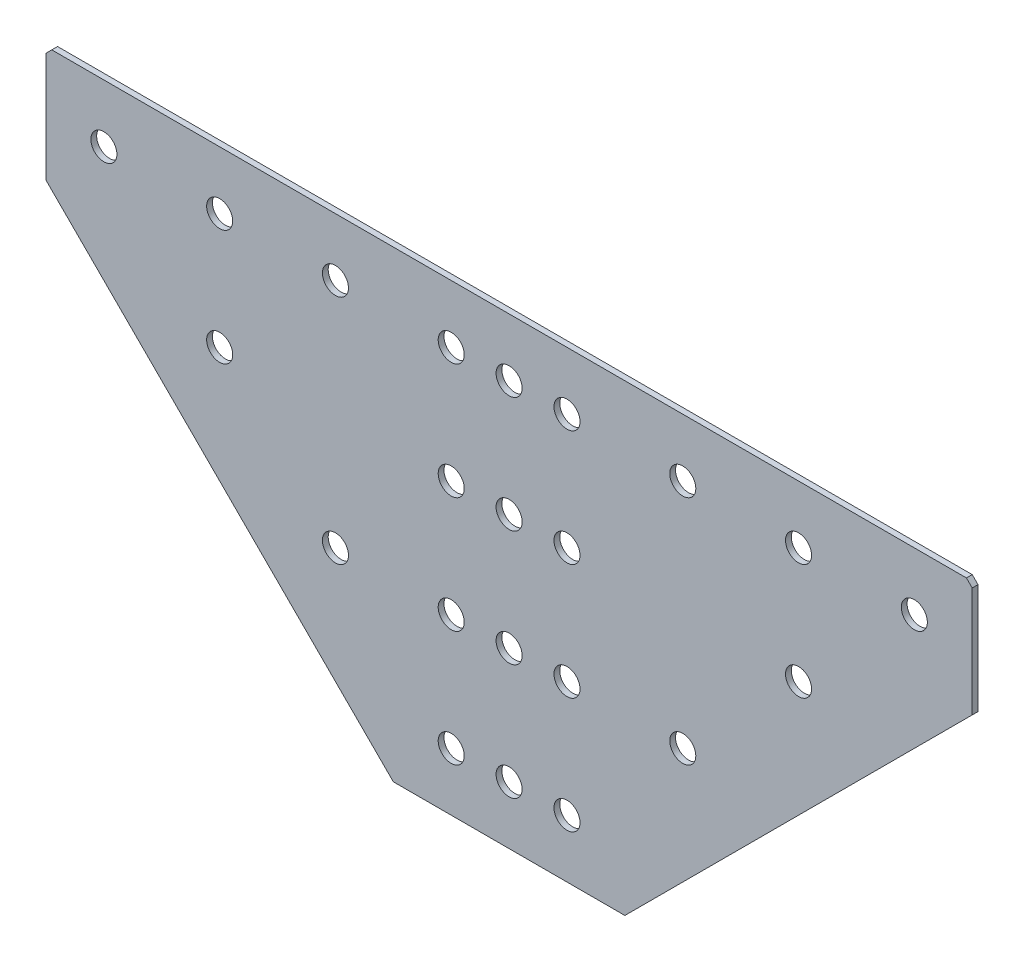
ISO-10303-21;
HEADER;
FILE_DESCRIPTION(('STEP AP214'),'2;1');
FILE_NAME('part.step','',(''),(''),'','','');
FILE_SCHEMA(('AUTOMOTIVE_DESIGN { 1 0 10303 214 1 1 1 1 }'));
ENDSEC;
DATA;
#1=APPLICATION_CONTEXT('core data for automotive mechanical design processes');
#2=APPLICATION_PROTOCOL_DEFINITION('international standard','automotive_design',2000,#1);
#3=PRODUCT_CONTEXT('',#1,'mechanical');
#4=PRODUCT('Part','Part','',(#3));
#5=PRODUCT_RELATED_PRODUCT_CATEGORY('part','',(#4));
#6=PRODUCT_DEFINITION_FORMATION('','',#4);
#7=PRODUCT_DEFINITION_CONTEXT('part definition',#1,'design');
#8=PRODUCT_DEFINITION('design','',#6,#7);
#9=PRODUCT_DEFINITION_SHAPE('','',#8);
#10=(LENGTH_UNIT() NAMED_UNIT(*) SI_UNIT(.MILLI.,.METRE.));
#11=(NAMED_UNIT(*) PLANE_ANGLE_UNIT() SI_UNIT($,.RADIAN.));
#12=(NAMED_UNIT(*) SI_UNIT($,.STERADIAN.) SOLID_ANGLE_UNIT());
#13=UNCERTAINTY_MEASURE_WITH_UNIT(LENGTH_MEASURE(1.E-05),#10,'distance_accuracy_value','');
#14=(GEOMETRIC_REPRESENTATION_CONTEXT(3) GLOBAL_UNCERTAINTY_ASSIGNED_CONTEXT((#13)) GLOBAL_UNIT_ASSIGNED_CONTEXT((#10,
#11,#12)) REPRESENTATION_CONTEXT('',''));
#15=CARTESIAN_POINT('',(0.,0.,0.));
#16=DIRECTION('',(0.,0.,1.));
#17=DIRECTION('',(1.,0.,0.));
#18=AXIS2_PLACEMENT_3D('',#15,#16,#17);
#19=CARTESIAN_POINT('',(-160.,0.,2.));
#20=DIRECTION('',(0.,-1.,0.));
#21=DIRECTION('',(0.,0.,-1.));
#22=AXIS2_PLACEMENT_3D('',#19,#20,#21);
#23=PLANE('',#22);
#24=DIRECTION('',(-1.,0.,0.));
#25=VECTOR('',#24,1.);
#26=CARTESIAN_POINT('',(-160.,0.,0.));
#27=LINE('',#26,#25);
#28=CARTESIAN_POINT('',(158.,0.,0.));
#29=VERTEX_POINT('',#28);
#30=CARTESIAN_POINT('',(-158.,0.,0.));
#31=VERTEX_POINT('',#30);
#32=EDGE_CURVE('E150',#29,#31,#27,.T.);
#33=ORIENTED_EDGE('',*,*,#32,.T.);
#34=DIRECTION('',(0.,0.,1.));
#35=VECTOR('',#34,1.);
#36=CARTESIAN_POINT('',(-158.,0.,2.));
#37=LINE('',#36,#35);
#38=CARTESIAN_POINT('',(-158.,0.,2.));
#39=VERTEX_POINT('',#38);
#40=EDGE_CURVE('E64',#31,#39,#37,.T.);
#41=ORIENTED_EDGE('',*,*,#40,.T.);
#42=DIRECTION('',(-1.,0.,0.));
#43=VECTOR('',#42,1.);
#44=CARTESIAN_POINT('',(-160.,0.,2.));
#45=LINE('',#44,#43);
#46=CARTESIAN_POINT('',(158.,0.,2.));
#47=VERTEX_POINT('',#46);
#48=EDGE_CURVE('E120',#47,#39,#45,.T.);
#49=ORIENTED_EDGE('',*,*,#48,.F.);
#50=DIRECTION('',(0.,0.,-1.));
#51=VECTOR('',#50,1.);
#52=CARTESIAN_POINT('',(158.,0.,2.));
#53=LINE('',#52,#51);
#54=EDGE_CURVE('E185',#47,#29,#53,.T.);
#55=ORIENTED_EDGE('',*,*,#54,.T.);
#56=EDGE_LOOP('',(#33,#41,#49,#55));
#57=FACE_BOUND('',#56,.T.);
#58=ADVANCED_FACE('F41',(#57),#23,.F.);
#59=CARTESIAN_POINT('',(-160.,-40.,2.));
#60=DIRECTION('',(1.,0.,0.));
#61=DIRECTION('',(0.,1.,0.));
#62=AXIS2_PLACEMENT_3D('',#59,#60,#61);
#63=PLANE('',#62);
#64=DIRECTION('',(0.,-1.,0.));
#65=VECTOR('',#64,1.);
#66=CARTESIAN_POINT('',(-160.,-40.,2.));
#67=LINE('',#66,#65);
#68=CARTESIAN_POINT('',(-160.,-2.,2.));
#69=VERTEX_POINT('',#68);
#70=CARTESIAN_POINT('',(-160.,-40.,2.));
#71=VERTEX_POINT('',#70);
#72=EDGE_CURVE('E109',#69,#71,#67,.T.);
#73=ORIENTED_EDGE('',*,*,#72,.F.);
#74=DIRECTION('',(0.,0.,-1.));
#75=VECTOR('',#74,1.);
#76=CARTESIAN_POINT('',(-160.,-2.,2.));
#77=LINE('',#76,#75);
#78=CARTESIAN_POINT('',(-160.,-2.,0.));
#79=VERTEX_POINT('',#78);
#80=EDGE_CURVE('E130',#69,#79,#77,.T.);
#81=ORIENTED_EDGE('',*,*,#80,.T.);
#82=DIRECTION('',(0.,-1.,0.));
#83=VECTOR('',#82,1.);
#84=CARTESIAN_POINT('',(-160.,-40.,0.));
#85=LINE('',#84,#83);
#86=CARTESIAN_POINT('',(-160.,-40.,0.));
#87=VERTEX_POINT('',#86);
#88=EDGE_CURVE('E126',#79,#87,#85,.T.);
#89=ORIENTED_EDGE('',*,*,#88,.T.);
#90=DIRECTION('',(0.,0.,-1.));
#91=VECTOR('',#90,1.);
#92=CARTESIAN_POINT('',(-160.,-40.,2.));
#93=LINE('',#92,#91);
#94=EDGE_CURVE('E123',#71,#87,#93,.T.);
#95=ORIENTED_EDGE('',*,*,#94,.F.);
#96=EDGE_LOOP('',(#73,#81,#89,#95));
#97=FACE_BOUND('',#96,.T.);
#98=ADVANCED_FACE('F124',(#97),#63,.F.);
#99=CARTESIAN_POINT('',(-40.,-160.,2.));
#100=DIRECTION('',(0.707106781186547,0.707106781186547,0.));
#101=DIRECTION('',(-0.707106781186548,0.707106781186548,0.));
#102=AXIS2_PLACEMENT_3D('',#99,#100,#101);
#103=PLANE('',#102);
#104=DIRECTION('',(0.707106781186547,-0.707106781186547,0.));
#105=VECTOR('',#104,1.);
#106=CARTESIAN_POINT('',(-40.,-160.,0.));
#107=LINE('',#106,#105);
#108=CARTESIAN_POINT('',(-40.,-160.,0.));
#109=VERTEX_POINT('',#108);
#110=EDGE_CURVE('E156',#87,#109,#107,.T.);
#111=ORIENTED_EDGE('',*,*,#110,.T.);
#112=DIRECTION('',(0.,0.,-1.));
#113=VECTOR('',#112,1.);
#114=CARTESIAN_POINT('',(-40.,-160.,2.));
#115=LINE('',#114,#113);
#116=CARTESIAN_POINT('',(-40.,-160.,2.));
#117=VERTEX_POINT('',#116);
#118=EDGE_CURVE('E131',#117,#109,#115,.T.);
#119=ORIENTED_EDGE('',*,*,#118,.F.);
#120=DIRECTION('',(0.707106781186547,-0.707106781186547,0.));
#121=VECTOR('',#120,1.);
#122=CARTESIAN_POINT('',(-40.,-160.,2.));
#123=LINE('',#122,#121);
#124=EDGE_CURVE('E113',#71,#117,#123,.T.);
#125=ORIENTED_EDGE('',*,*,#124,.F.);
#126=ORIENTED_EDGE('',*,*,#94,.T.);
#127=EDGE_LOOP('',(#111,#119,#125,#126));
#128=FACE_BOUND('',#127,.T.);
#129=ADVANCED_FACE('F133',(#128),#103,.F.);
#130=CARTESIAN_POINT('',(40.,-160.,2.));
#131=DIRECTION('',(0.,1.,0.));
#132=DIRECTION('',(0.,0.,1.));
#133=AXIS2_PLACEMENT_3D('',#130,#131,#132);
#134=PLANE('',#133);
#135=DIRECTION('',(1.,0.,0.));
#136=VECTOR('',#135,1.);
#137=CARTESIAN_POINT('',(40.,-160.,0.));
#138=LINE('',#137,#136);
#139=CARTESIAN_POINT('',(40.,-160.,0.));
#140=VERTEX_POINT('',#139);
#141=EDGE_CURVE('E159',#109,#140,#138,.T.);
#142=ORIENTED_EDGE('',*,*,#141,.T.);
#143=DIRECTION('',(0.,0.,-1.));
#144=VECTOR('',#143,1.);
#145=CARTESIAN_POINT('',(40.,-160.,2.));
#146=LINE('',#145,#144);
#147=CARTESIAN_POINT('',(40.,-160.,2.));
#148=VERTEX_POINT('',#147);
#149=EDGE_CURVE('E171',#148,#140,#146,.T.);
#150=ORIENTED_EDGE('',*,*,#149,.F.);
#151=DIRECTION('',(1.,0.,0.));
#152=VECTOR('',#151,1.);
#153=CARTESIAN_POINT('',(40.,-160.,2.));
#154=LINE('',#153,#152);
#155=EDGE_CURVE('E137',#117,#148,#154,.T.);
#156=ORIENTED_EDGE('',*,*,#155,.F.);
#157=ORIENTED_EDGE('',*,*,#118,.T.);
#158=EDGE_LOOP('',(#142,#150,#156,#157));
#159=FACE_BOUND('',#158,.T.);
#160=ADVANCED_FACE('F211',(#159),#134,.F.);
#161=CARTESIAN_POINT('',(160.,-40.,2.));
#162=DIRECTION('',(-0.707106781186547,0.707106781186547,0.));
#163=DIRECTION('',(-0.707106781186548,-0.707106781186548,0.));
#164=AXIS2_PLACEMENT_3D('',#161,#162,#163);
#165=PLANE('',#164);
#166=DIRECTION('',(0.707106781186547,0.707106781186547,0.));
#167=VECTOR('',#166,1.);
#168=CARTESIAN_POINT('',(160.,-40.,0.));
#169=LINE('',#168,#167);
#170=CARTESIAN_POINT('',(160.,-40.,0.));
#171=VERTEX_POINT('',#170);
#172=EDGE_CURVE('E162',#140,#171,#169,.T.);
#173=ORIENTED_EDGE('',*,*,#172,.T.);
#174=DIRECTION('',(0.,0.,-1.));
#175=VECTOR('',#174,1.);
#176=CARTESIAN_POINT('',(160.,-40.,2.));
#177=LINE('',#176,#175);
#178=CARTESIAN_POINT('',(160.,-40.,2.));
#179=VERTEX_POINT('',#178);
#180=EDGE_CURVE('E149',#179,#171,#177,.T.);
#181=ORIENTED_EDGE('',*,*,#180,.F.);
#182=DIRECTION('',(0.707106781186547,0.707106781186547,0.));
#183=VECTOR('',#182,1.);
#184=CARTESIAN_POINT('',(160.,-40.,2.));
#185=LINE('',#184,#183);
#186=EDGE_CURVE('E140',#148,#179,#185,.T.);
#187=ORIENTED_EDGE('',*,*,#186,.F.);
#188=ORIENTED_EDGE('',*,*,#149,.T.);
#189=EDGE_LOOP('',(#173,#181,#187,#188));
#190=FACE_BOUND('',#189,.T.);
#191=ADVANCED_FACE('F207',(#190),#165,.F.);
#192=CARTESIAN_POINT('',(160.,0.,2.));
#193=DIRECTION('',(-1.,0.,0.));
#194=DIRECTION('',(0.,-1.,0.));
#195=AXIS2_PLACEMENT_3D('',#192,#193,#194);
#196=PLANE('',#195);
#197=DIRECTION('',(0.,1.,0.));
#198=VECTOR('',#197,1.);
#199=CARTESIAN_POINT('',(160.,0.,0.));
#200=LINE('',#199,#198);
#201=CARTESIAN_POINT('',(160.,-2.00000000000006,0.));
#202=VERTEX_POINT('',#201);
#203=EDGE_CURVE('E165',#171,#202,#200,.T.);
#204=ORIENTED_EDGE('',*,*,#203,.T.);
#205=DIRECTION('',(0.,0.,1.));
#206=VECTOR('',#205,1.);
#207=CARTESIAN_POINT('',(160.,-2.00000000000006,2.));
#208=LINE('',#207,#206);
#209=CARTESIAN_POINT('',(160.,-2.00000000000006,2.));
#210=VERTEX_POINT('',#209);
#211=EDGE_CURVE('E11',#202,#210,#208,.T.);
#212=ORIENTED_EDGE('',*,*,#211,.T.);
#213=DIRECTION('',(0.,1.,0.));
#214=VECTOR('',#213,1.);
#215=CARTESIAN_POINT('',(160.,0.,2.));
#216=LINE('',#215,#214);
#217=EDGE_CURVE('E146',#179,#210,#216,.T.);
#218=ORIENTED_EDGE('',*,*,#217,.F.);
#219=ORIENTED_EDGE('',*,*,#180,.T.);
#220=EDGE_LOOP('',(#204,#212,#218,#219));
#221=FACE_BOUND('',#220,.T.);
#222=ADVANCED_FACE('F203',(#221),#196,.F.);
#223=CARTESIAN_POINT('',(0.,0.,2.));
#224=DIRECTION('',(0.,0.,-1.));
#225=DIRECTION('',(-1.,0.,0.));
#226=AXIS2_PLACEMENT_3D('',#223,#224,#225);
#227=PLANE('',#226);
#228=CARTESIAN_POINT('',(0.,-20.,2.));
#229=DIRECTION('',(0.,0.,1.));
#230=DIRECTION('',(1.,0.,0.));
#231=AXIS2_PLACEMENT_3D('',#228,#229,#230);
#232=CIRCLE('',#231,4.5);
#233=CARTESIAN_POINT('',(4.5,-20.,2.));
#234=VERTEX_POINT('',#233);
#235=EDGE_CURVE('E493',#234,#234,#232,.T.);
#236=ORIENTED_EDGE('',*,*,#235,.F.);
#237=EDGE_LOOP('',(#236));
#238=FACE_BOUND('',#237,.T.);
#239=CARTESIAN_POINT('',(20.,-20.,2.));
#240=DIRECTION('',(0.,0.,1.));
#241=DIRECTION('',(1.,0.,0.));
#242=AXIS2_PLACEMENT_3D('',#239,#240,#241);
#243=CIRCLE('',#242,4.5);
#244=CARTESIAN_POINT('',(24.5,-20.,2.));
#245=VERTEX_POINT('',#244);
#246=EDGE_CURVE('E497',#245,#245,#243,.T.);
#247=ORIENTED_EDGE('',*,*,#246,.F.);
#248=EDGE_LOOP('',(#247));
#249=FACE_BOUND('',#248,.T.);
#250=CARTESIAN_POINT('',(-20.,-20.,2.));
#251=DIRECTION('',(0.,0.,1.));
#252=DIRECTION('',(1.,0.,0.));
#253=AXIS2_PLACEMENT_3D('',#250,#251,#252);
#254=CIRCLE('',#253,4.5);
#255=CARTESIAN_POINT('',(-15.5,-20.,2.));
#256=VERTEX_POINT('',#255);
#257=EDGE_CURVE('E507',#256,#256,#254,.T.);
#258=ORIENTED_EDGE('',*,*,#257,.F.);
#259=EDGE_LOOP('',(#258));
#260=FACE_BOUND('',#259,.T.);
#261=CARTESIAN_POINT('',(-20.,-60.,2.));
#262=DIRECTION('',(0.,0.,1.));
#263=DIRECTION('',(1.,0.,0.));
#264=AXIS2_PLACEMENT_3D('',#261,#262,#263);
#265=CIRCLE('',#264,4.5);
#266=CARTESIAN_POINT('',(-15.5,-60.,2.));
#267=VERTEX_POINT('',#266);
#268=EDGE_CURVE('E515',#267,#267,#265,.T.);
#269=ORIENTED_EDGE('',*,*,#268,.F.);
#270=EDGE_LOOP('',(#269));
#271=FACE_BOUND('',#270,.T.);
#272=CARTESIAN_POINT('',(-20.,-100.,2.));
#273=DIRECTION('',(0.,0.,1.));
#274=DIRECTION('',(1.,0.,0.));
#275=AXIS2_PLACEMENT_3D('',#272,#273,#274);
#276=CIRCLE('',#275,4.5);
#277=CARTESIAN_POINT('',(-15.5,-100.,2.));
#278=VERTEX_POINT('',#277);
#279=EDGE_CURVE('E523',#278,#278,#276,.T.);
#280=ORIENTED_EDGE('',*,*,#279,.F.);
#281=EDGE_LOOP('',(#280));
#282=FACE_BOUND('',#281,.T.);
#283=CARTESIAN_POINT('',(-20.,-140.,2.));
#284=DIRECTION('',(0.,0.,1.));
#285=DIRECTION('',(1.,0.,0.));
#286=AXIS2_PLACEMENT_3D('',#283,#284,#285);
#287=CIRCLE('',#286,4.5);
#288=CARTESIAN_POINT('',(-15.5,-140.,2.));
#289=VERTEX_POINT('',#288);
#290=EDGE_CURVE('E531',#289,#289,#287,.T.);
#291=ORIENTED_EDGE('',*,*,#290,.F.);
#292=EDGE_LOOP('',(#291));
#293=FACE_BOUND('',#292,.T.);
#294=CARTESIAN_POINT('',(0.,-60.,2.));
#295=DIRECTION('',(0.,0.,1.));
#296=DIRECTION('',(1.,0.,0.));
#297=AXIS2_PLACEMENT_3D('',#294,#295,#296);
#298=CIRCLE('',#297,4.5);
#299=CARTESIAN_POINT('',(4.50000000000001,-60.,2.));
#300=VERTEX_POINT('',#299);
#301=EDGE_CURVE('E539',#300,#300,#298,.T.);
#302=ORIENTED_EDGE('',*,*,#301,.F.);
#303=EDGE_LOOP('',(#302));
#304=FACE_BOUND('',#303,.T.);
#305=CARTESIAN_POINT('',(0.,-100.,2.));
#306=DIRECTION('',(0.,0.,1.));
#307=DIRECTION('',(1.,0.,0.));
#308=AXIS2_PLACEMENT_3D('',#305,#306,#307);
#309=CIRCLE('',#308,4.5);
#310=CARTESIAN_POINT('',(4.50000000000001,-100.,2.));
#311=VERTEX_POINT('',#310);
#312=EDGE_CURVE('E547',#311,#311,#309,.T.);
#313=ORIENTED_EDGE('',*,*,#312,.F.);
#314=EDGE_LOOP('',(#313));
#315=FACE_BOUND('',#314,.T.);
#316=CARTESIAN_POINT('',(0.,-140.,2.));
#317=DIRECTION('',(0.,0.,1.));
#318=DIRECTION('',(1.,0.,0.));
#319=AXIS2_PLACEMENT_3D('',#316,#317,#318);
#320=CIRCLE('',#319,4.5);
#321=CARTESIAN_POINT('',(4.50000000000001,-140.,2.));
#322=VERTEX_POINT('',#321);
#323=EDGE_CURVE('E555',#322,#322,#320,.T.);
#324=ORIENTED_EDGE('',*,*,#323,.F.);
#325=EDGE_LOOP('',(#324));
#326=FACE_BOUND('',#325,.T.);
#327=CARTESIAN_POINT('',(20.,-60.,2.));
#328=DIRECTION('',(0.,0.,1.));
#329=DIRECTION('',(1.,0.,0.));
#330=AXIS2_PLACEMENT_3D('',#327,#328,#329);
#331=CIRCLE('',#330,4.5);
#332=CARTESIAN_POINT('',(24.5,-60.,2.));
#333=VERTEX_POINT('',#332);
#334=EDGE_CURVE('E563',#333,#333,#331,.T.);
#335=ORIENTED_EDGE('',*,*,#334,.F.);
#336=EDGE_LOOP('',(#335));
#337=FACE_BOUND('',#336,.T.);
#338=CARTESIAN_POINT('',(20.,-100.,2.));
#339=DIRECTION('',(0.,0.,1.));
#340=DIRECTION('',(1.,0.,0.));
#341=AXIS2_PLACEMENT_3D('',#338,#339,#340);
#342=CIRCLE('',#341,4.5);
#343=CARTESIAN_POINT('',(24.5,-100.,2.));
#344=VERTEX_POINT('',#343);
#345=EDGE_CURVE('E571',#344,#344,#342,.T.);
#346=ORIENTED_EDGE('',*,*,#345,.F.);
#347=EDGE_LOOP('',(#346));
#348=FACE_BOUND('',#347,.T.);
#349=CARTESIAN_POINT('',(20.,-140.,2.));
#350=DIRECTION('',(0.,0.,1.));
#351=DIRECTION('',(1.,0.,0.));
#352=AXIS2_PLACEMENT_3D('',#349,#350,#351);
#353=CIRCLE('',#352,4.5);
#354=CARTESIAN_POINT('',(24.5,-140.,2.));
#355=VERTEX_POINT('',#354);
#356=EDGE_CURVE('E579',#355,#355,#353,.T.);
#357=ORIENTED_EDGE('',*,*,#356,.F.);
#358=EDGE_LOOP('',(#357));
#359=FACE_BOUND('',#358,.T.);
#360=CARTESIAN_POINT('',(-60.,-20.,2.));
#361=DIRECTION('',(0.,0.,1.));
#362=DIRECTION('',(1.,0.,0.));
#363=AXIS2_PLACEMENT_3D('',#360,#361,#362);
#364=CIRCLE('',#363,4.5);
#365=CARTESIAN_POINT('',(-55.5,-20.,2.));
#366=VERTEX_POINT('',#365);
#367=EDGE_CURVE('E587',#366,#366,#364,.T.);
#368=ORIENTED_EDGE('',*,*,#367,.F.);
#369=EDGE_LOOP('',(#368));
#370=FACE_BOUND('',#369,.T.);
#371=CARTESIAN_POINT('',(-100.,-20.,2.));
#372=DIRECTION('',(0.,0.,1.));
#373=DIRECTION('',(1.,0.,0.));
#374=AXIS2_PLACEMENT_3D('',#371,#372,#373);
#375=CIRCLE('',#374,4.5);
#376=CARTESIAN_POINT('',(-95.5,-20.,2.));
#377=VERTEX_POINT('',#376);
#378=EDGE_CURVE('E595',#377,#377,#375,.T.);
#379=ORIENTED_EDGE('',*,*,#378,.F.);
#380=EDGE_LOOP('',(#379));
#381=FACE_BOUND('',#380,.T.);
#382=CARTESIAN_POINT('',(-140.,-20.,2.));
#383=DIRECTION('',(0.,0.,1.));
#384=DIRECTION('',(1.,0.,0.));
#385=AXIS2_PLACEMENT_3D('',#382,#383,#384);
#386=CIRCLE('',#385,4.5);
#387=CARTESIAN_POINT('',(-135.5,-20.,2.));
#388=VERTEX_POINT('',#387);
#389=EDGE_CURVE('E603',#388,#388,#386,.T.);
#390=ORIENTED_EDGE('',*,*,#389,.F.);
#391=EDGE_LOOP('',(#390));
#392=FACE_BOUND('',#391,.T.);
#393=CARTESIAN_POINT('',(60.,-20.,2.));
#394=DIRECTION('',(0.,0.,1.));
#395=DIRECTION('',(1.,0.,0.));
#396=AXIS2_PLACEMENT_3D('',#393,#394,#395);
#397=CIRCLE('',#396,4.5);
#398=CARTESIAN_POINT('',(64.5,-20.,2.));
#399=VERTEX_POINT('',#398);
#400=EDGE_CURVE('E611',#399,#399,#397,.T.);
#401=ORIENTED_EDGE('',*,*,#400,.F.);
#402=EDGE_LOOP('',(#401));
#403=FACE_BOUND('',#402,.T.);
#404=CARTESIAN_POINT('',(100.,-20.,2.));
#405=DIRECTION('',(0.,0.,1.));
#406=DIRECTION('',(1.,0.,0.));
#407=AXIS2_PLACEMENT_3D('',#404,#405,#406);
#408=CIRCLE('',#407,4.5);
#409=CARTESIAN_POINT('',(104.5,-20.,2.));
#410=VERTEX_POINT('',#409);
#411=EDGE_CURVE('E619',#410,#410,#408,.T.);
#412=ORIENTED_EDGE('',*,*,#411,.F.);
#413=EDGE_LOOP('',(#412));
#414=FACE_BOUND('',#413,.T.);
#415=CARTESIAN_POINT('',(140.,-20.,2.));
#416=DIRECTION('',(0.,0.,1.));
#417=DIRECTION('',(1.,0.,0.));
#418=AXIS2_PLACEMENT_3D('',#415,#416,#417);
#419=CIRCLE('',#418,4.5);
#420=CARTESIAN_POINT('',(144.5,-20.,2.));
#421=VERTEX_POINT('',#420);
#422=EDGE_CURVE('E627',#421,#421,#419,.T.);
#423=ORIENTED_EDGE('',*,*,#422,.F.);
#424=EDGE_LOOP('',(#423));
#425=FACE_BOUND('',#424,.T.);
#426=CARTESIAN_POINT('',(-100.,-60.,2.));
#427=DIRECTION('',(0.,0.,1.));
#428=DIRECTION('',(1.,0.,0.));
#429=AXIS2_PLACEMENT_3D('',#426,#427,#428);
#430=CIRCLE('',#429,4.5);
#431=CARTESIAN_POINT('',(-95.5,-60.,2.));
#432=VERTEX_POINT('',#431);
#433=EDGE_CURVE('E635',#432,#432,#430,.T.);
#434=ORIENTED_EDGE('',*,*,#433,.F.);
#435=EDGE_LOOP('',(#434));
#436=FACE_BOUND('',#435,.T.);
#437=CARTESIAN_POINT('',(100.,-60.,2.));
#438=DIRECTION('',(0.,0.,1.));
#439=DIRECTION('',(1.,0.,0.));
#440=AXIS2_PLACEMENT_3D('',#437,#438,#439);
#441=CIRCLE('',#440,4.5);
#442=CARTESIAN_POINT('',(104.5,-60.,2.));
#443=VERTEX_POINT('',#442);
#444=EDGE_CURVE('E643',#443,#443,#441,.T.);
#445=ORIENTED_EDGE('',*,*,#444,.F.);
#446=EDGE_LOOP('',(#445));
#447=FACE_BOUND('',#446,.T.);
#448=CARTESIAN_POINT('',(-60.,-100.,2.));
#449=DIRECTION('',(0.,0.,1.));
#450=DIRECTION('',(1.,0.,0.));
#451=AXIS2_PLACEMENT_3D('',#448,#449,#450);
#452=CIRCLE('',#451,4.5);
#453=CARTESIAN_POINT('',(-55.5,-100.,2.));
#454=VERTEX_POINT('',#453);
#455=EDGE_CURVE('E651',#454,#454,#452,.T.);
#456=ORIENTED_EDGE('',*,*,#455,.F.);
#457=EDGE_LOOP('',(#456));
#458=FACE_BOUND('',#457,.T.);
#459=CARTESIAN_POINT('',(60.,-100.,2.));
#460=DIRECTION('',(0.,0.,1.));
#461=DIRECTION('',(1.,0.,0.));
#462=AXIS2_PLACEMENT_3D('',#459,#460,#461);
#463=CIRCLE('',#462,4.5);
#464=CARTESIAN_POINT('',(64.5,-100.,2.));
#465=VERTEX_POINT('',#464);
#466=EDGE_CURVE('E659',#465,#465,#463,.T.);
#467=ORIENTED_EDGE('',*,*,#466,.F.);
#468=EDGE_LOOP('',(#467));
#469=FACE_BOUND('',#468,.T.);
#470=ORIENTED_EDGE('',*,*,#48,.T.);
#471=DIRECTION('',(0.707106781186548,0.707106781186548,0.));
#472=VECTOR('',#471,1.);
#473=CARTESIAN_POINT('',(-160.,-2.,2.));
#474=LINE('',#473,#472);
#475=EDGE_CURVE('E51',#39,#69,#474,.F.);
#476=ORIENTED_EDGE('',*,*,#475,.T.);
#477=ORIENTED_EDGE('',*,*,#72,.T.);
#478=ORIENTED_EDGE('',*,*,#124,.T.);
#479=ORIENTED_EDGE('',*,*,#155,.T.);
#480=ORIENTED_EDGE('',*,*,#186,.T.);
#481=ORIENTED_EDGE('',*,*,#217,.T.);
#482=DIRECTION('',(0.707106781186548,-0.707106781186548,0.));
#483=VECTOR('',#482,1.);
#484=CARTESIAN_POINT('',(158.,0.,2.));
#485=LINE('',#484,#483);
#486=EDGE_CURVE('E191',#210,#47,#485,.F.);
#487=ORIENTED_EDGE('',*,*,#486,.T.);
#488=EDGE_LOOP('',(#470,#476,#477,#478,#479,#480,#481,#487));
#489=FACE_BOUND('',#488,.T.);
#490=ADVANCED_FACE('F111',(#238,#249,#260,#271,#282,#293,#304,#315,#326,#337,#348,#359,#370,
#381,#392,#403,#414,#425,#436,#447,#458,#469,#489),#227,.F.);
#491=CARTESIAN_POINT('',(0.,0.,0.));
#492=DIRECTION('',(0.,0.,-1.));
#493=DIRECTION('',(-1.,0.,0.));
#494=AXIS2_PLACEMENT_3D('',#491,#492,#493);
#495=PLANE('',#494);
#496=CARTESIAN_POINT('',(0.,-20.,0.));
#497=DIRECTION('',(0.,0.,1.));
#498=DIRECTION('',(1.,0.,0.));
#499=AXIS2_PLACEMENT_3D('',#496,#497,#498);
#500=CIRCLE('',#499,4.5);
#501=CARTESIAN_POINT('',(4.5,-20.,0.));
#502=VERTEX_POINT('',#501);
#503=EDGE_CURVE('E490',#502,#502,#500,.T.);
#504=ORIENTED_EDGE('',*,*,#503,.T.);
#505=EDGE_LOOP('',(#504));
#506=FACE_BOUND('',#505,.T.);
#507=CARTESIAN_POINT('',(20.,-20.,0.));
#508=DIRECTION('',(0.,0.,1.));
#509=DIRECTION('',(1.,0.,0.));
#510=AXIS2_PLACEMENT_3D('',#507,#508,#509);
#511=CIRCLE('',#510,4.5);
#512=CARTESIAN_POINT('',(24.5,-20.,0.));
#513=VERTEX_POINT('',#512);
#514=EDGE_CURVE('E503',#513,#513,#511,.T.);
#515=ORIENTED_EDGE('',*,*,#514,.T.);
#516=EDGE_LOOP('',(#515));
#517=FACE_BOUND('',#516,.T.);
#518=CARTESIAN_POINT('',(-20.,-20.,0.));
#519=DIRECTION('',(0.,0.,1.));
#520=DIRECTION('',(1.,0.,0.));
#521=AXIS2_PLACEMENT_3D('',#518,#519,#520);
#522=CIRCLE('',#521,4.5);
#523=CARTESIAN_POINT('',(-15.5,-20.,0.));
#524=VERTEX_POINT('',#523);
#525=EDGE_CURVE('E511',#524,#524,#522,.T.);
#526=ORIENTED_EDGE('',*,*,#525,.T.);
#527=EDGE_LOOP('',(#526));
#528=FACE_BOUND('',#527,.T.);
#529=CARTESIAN_POINT('',(-20.,-60.,0.));
#530=DIRECTION('',(0.,0.,1.));
#531=DIRECTION('',(1.,0.,0.));
#532=AXIS2_PLACEMENT_3D('',#529,#530,#531);
#533=CIRCLE('',#532,4.5);
#534=CARTESIAN_POINT('',(-15.5,-60.,0.));
#535=VERTEX_POINT('',#534);
#536=EDGE_CURVE('E519',#535,#535,#533,.T.);
#537=ORIENTED_EDGE('',*,*,#536,.T.);
#538=EDGE_LOOP('',(#537));
#539=FACE_BOUND('',#538,.T.);
#540=CARTESIAN_POINT('',(-20.,-100.,0.));
#541=DIRECTION('',(0.,0.,1.));
#542=DIRECTION('',(1.,0.,0.));
#543=AXIS2_PLACEMENT_3D('',#540,#541,#542);
#544=CIRCLE('',#543,4.5);
#545=CARTESIAN_POINT('',(-15.5,-100.,0.));
#546=VERTEX_POINT('',#545);
#547=EDGE_CURVE('E527',#546,#546,#544,.T.);
#548=ORIENTED_EDGE('',*,*,#547,.T.);
#549=EDGE_LOOP('',(#548));
#550=FACE_BOUND('',#549,.T.);
#551=CARTESIAN_POINT('',(-20.,-140.,0.));
#552=DIRECTION('',(0.,0.,1.));
#553=DIRECTION('',(1.,0.,0.));
#554=AXIS2_PLACEMENT_3D('',#551,#552,#553);
#555=CIRCLE('',#554,4.5);
#556=CARTESIAN_POINT('',(-15.5,-140.,0.));
#557=VERTEX_POINT('',#556);
#558=EDGE_CURVE('E535',#557,#557,#555,.T.);
#559=ORIENTED_EDGE('',*,*,#558,.T.);
#560=EDGE_LOOP('',(#559));
#561=FACE_BOUND('',#560,.T.);
#562=CARTESIAN_POINT('',(0.,-60.,0.));
#563=DIRECTION('',(0.,0.,1.));
#564=DIRECTION('',(1.,0.,0.));
#565=AXIS2_PLACEMENT_3D('',#562,#563,#564);
#566=CIRCLE('',#565,4.5);
#567=CARTESIAN_POINT('',(4.50000000000001,-60.,0.));
#568=VERTEX_POINT('',#567);
#569=EDGE_CURVE('E543',#568,#568,#566,.T.);
#570=ORIENTED_EDGE('',*,*,#569,.T.);
#571=EDGE_LOOP('',(#570));
#572=FACE_BOUND('',#571,.T.);
#573=CARTESIAN_POINT('',(0.,-100.,0.));
#574=DIRECTION('',(0.,0.,1.));
#575=DIRECTION('',(1.,0.,0.));
#576=AXIS2_PLACEMENT_3D('',#573,#574,#575);
#577=CIRCLE('',#576,4.5);
#578=CARTESIAN_POINT('',(4.50000000000001,-100.,0.));
#579=VERTEX_POINT('',#578);
#580=EDGE_CURVE('E551',#579,#579,#577,.T.);
#581=ORIENTED_EDGE('',*,*,#580,.T.);
#582=EDGE_LOOP('',(#581));
#583=FACE_BOUND('',#582,.T.);
#584=CARTESIAN_POINT('',(0.,-140.,0.));
#585=DIRECTION('',(0.,0.,1.));
#586=DIRECTION('',(1.,0.,0.));
#587=AXIS2_PLACEMENT_3D('',#584,#585,#586);
#588=CIRCLE('',#587,4.5);
#589=CARTESIAN_POINT('',(4.50000000000001,-140.,0.));
#590=VERTEX_POINT('',#589);
#591=EDGE_CURVE('E559',#590,#590,#588,.T.);
#592=ORIENTED_EDGE('',*,*,#591,.T.);
#593=EDGE_LOOP('',(#592));
#594=FACE_BOUND('',#593,.T.);
#595=CARTESIAN_POINT('',(20.,-60.,0.));
#596=DIRECTION('',(0.,0.,1.));
#597=DIRECTION('',(1.,0.,0.));
#598=AXIS2_PLACEMENT_3D('',#595,#596,#597);
#599=CIRCLE('',#598,4.5);
#600=CARTESIAN_POINT('',(24.5,-60.,0.));
#601=VERTEX_POINT('',#600);
#602=EDGE_CURVE('E567',#601,#601,#599,.T.);
#603=ORIENTED_EDGE('',*,*,#602,.T.);
#604=EDGE_LOOP('',(#603));
#605=FACE_BOUND('',#604,.T.);
#606=CARTESIAN_POINT('',(20.,-100.,0.));
#607=DIRECTION('',(0.,0.,1.));
#608=DIRECTION('',(1.,0.,0.));
#609=AXIS2_PLACEMENT_3D('',#606,#607,#608);
#610=CIRCLE('',#609,4.5);
#611=CARTESIAN_POINT('',(24.5,-100.,0.));
#612=VERTEX_POINT('',#611);
#613=EDGE_CURVE('E575',#612,#612,#610,.T.);
#614=ORIENTED_EDGE('',*,*,#613,.T.);
#615=EDGE_LOOP('',(#614));
#616=FACE_BOUND('',#615,.T.);
#617=CARTESIAN_POINT('',(20.,-140.,0.));
#618=DIRECTION('',(0.,0.,1.));
#619=DIRECTION('',(1.,0.,0.));
#620=AXIS2_PLACEMENT_3D('',#617,#618,#619);
#621=CIRCLE('',#620,4.5);
#622=CARTESIAN_POINT('',(24.5,-140.,0.));
#623=VERTEX_POINT('',#622);
#624=EDGE_CURVE('E583',#623,#623,#621,.T.);
#625=ORIENTED_EDGE('',*,*,#624,.T.);
#626=EDGE_LOOP('',(#625));
#627=FACE_BOUND('',#626,.T.);
#628=CARTESIAN_POINT('',(-60.,-20.,0.));
#629=DIRECTION('',(0.,0.,1.));
#630=DIRECTION('',(1.,0.,0.));
#631=AXIS2_PLACEMENT_3D('',#628,#629,#630);
#632=CIRCLE('',#631,4.5);
#633=CARTESIAN_POINT('',(-55.5,-20.,0.));
#634=VERTEX_POINT('',#633);
#635=EDGE_CURVE('E591',#634,#634,#632,.T.);
#636=ORIENTED_EDGE('',*,*,#635,.T.);
#637=EDGE_LOOP('',(#636));
#638=FACE_BOUND('',#637,.T.);
#639=CARTESIAN_POINT('',(-100.,-20.,0.));
#640=DIRECTION('',(0.,0.,1.));
#641=DIRECTION('',(1.,0.,0.));
#642=AXIS2_PLACEMENT_3D('',#639,#640,#641);
#643=CIRCLE('',#642,4.5);
#644=CARTESIAN_POINT('',(-95.5,-20.,0.));
#645=VERTEX_POINT('',#644);
#646=EDGE_CURVE('E599',#645,#645,#643,.T.);
#647=ORIENTED_EDGE('',*,*,#646,.T.);
#648=EDGE_LOOP('',(#647));
#649=FACE_BOUND('',#648,.T.);
#650=CARTESIAN_POINT('',(-140.,-20.,0.));
#651=DIRECTION('',(0.,0.,1.));
#652=DIRECTION('',(1.,0.,0.));
#653=AXIS2_PLACEMENT_3D('',#650,#651,#652);
#654=CIRCLE('',#653,4.5);
#655=CARTESIAN_POINT('',(-135.5,-20.,0.));
#656=VERTEX_POINT('',#655);
#657=EDGE_CURVE('E607',#656,#656,#654,.T.);
#658=ORIENTED_EDGE('',*,*,#657,.T.);
#659=EDGE_LOOP('',(#658));
#660=FACE_BOUND('',#659,.T.);
#661=CARTESIAN_POINT('',(60.,-20.,0.));
#662=DIRECTION('',(0.,0.,1.));
#663=DIRECTION('',(1.,0.,0.));
#664=AXIS2_PLACEMENT_3D('',#661,#662,#663);
#665=CIRCLE('',#664,4.5);
#666=CARTESIAN_POINT('',(64.5,-20.,0.));
#667=VERTEX_POINT('',#666);
#668=EDGE_CURVE('E615',#667,#667,#665,.T.);
#669=ORIENTED_EDGE('',*,*,#668,.T.);
#670=EDGE_LOOP('',(#669));
#671=FACE_BOUND('',#670,.T.);
#672=CARTESIAN_POINT('',(100.,-20.,0.));
#673=DIRECTION('',(0.,0.,1.));
#674=DIRECTION('',(1.,0.,0.));
#675=AXIS2_PLACEMENT_3D('',#672,#673,#674);
#676=CIRCLE('',#675,4.5);
#677=CARTESIAN_POINT('',(104.5,-20.,0.));
#678=VERTEX_POINT('',#677);
#679=EDGE_CURVE('E623',#678,#678,#676,.T.);
#680=ORIENTED_EDGE('',*,*,#679,.T.);
#681=EDGE_LOOP('',(#680));
#682=FACE_BOUND('',#681,.T.);
#683=CARTESIAN_POINT('',(140.,-20.,0.));
#684=DIRECTION('',(0.,0.,1.));
#685=DIRECTION('',(1.,0.,0.));
#686=AXIS2_PLACEMENT_3D('',#683,#684,#685);
#687=CIRCLE('',#686,4.5);
#688=CARTESIAN_POINT('',(144.5,-20.,0.));
#689=VERTEX_POINT('',#688);
#690=EDGE_CURVE('E631',#689,#689,#687,.T.);
#691=ORIENTED_EDGE('',*,*,#690,.T.);
#692=EDGE_LOOP('',(#691));
#693=FACE_BOUND('',#692,.T.);
#694=CARTESIAN_POINT('',(-100.,-60.,0.));
#695=DIRECTION('',(0.,0.,1.));
#696=DIRECTION('',(1.,0.,0.));
#697=AXIS2_PLACEMENT_3D('',#694,#695,#696);
#698=CIRCLE('',#697,4.5);
#699=CARTESIAN_POINT('',(-95.5,-60.,0.));
#700=VERTEX_POINT('',#699);
#701=EDGE_CURVE('E639',#700,#700,#698,.T.);
#702=ORIENTED_EDGE('',*,*,#701,.T.);
#703=EDGE_LOOP('',(#702));
#704=FACE_BOUND('',#703,.T.);
#705=CARTESIAN_POINT('',(100.,-60.,0.));
#706=DIRECTION('',(0.,0.,1.));
#707=DIRECTION('',(1.,0.,0.));
#708=AXIS2_PLACEMENT_3D('',#705,#706,#707);
#709=CIRCLE('',#708,4.5);
#710=CARTESIAN_POINT('',(104.5,-60.,0.));
#711=VERTEX_POINT('',#710);
#712=EDGE_CURVE('E647',#711,#711,#709,.T.);
#713=ORIENTED_EDGE('',*,*,#712,.T.);
#714=EDGE_LOOP('',(#713));
#715=FACE_BOUND('',#714,.T.);
#716=CARTESIAN_POINT('',(-60.,-100.,0.));
#717=DIRECTION('',(0.,0.,1.));
#718=DIRECTION('',(1.,0.,0.));
#719=AXIS2_PLACEMENT_3D('',#716,#717,#718);
#720=CIRCLE('',#719,4.5);
#721=CARTESIAN_POINT('',(-55.5,-100.,0.));
#722=VERTEX_POINT('',#721);
#723=EDGE_CURVE('E655',#722,#722,#720,.T.);
#724=ORIENTED_EDGE('',*,*,#723,.T.);
#725=EDGE_LOOP('',(#724));
#726=FACE_BOUND('',#725,.T.);
#727=CARTESIAN_POINT('',(60.,-100.,0.));
#728=DIRECTION('',(0.,0.,1.));
#729=DIRECTION('',(1.,0.,0.));
#730=AXIS2_PLACEMENT_3D('',#727,#728,#729);
#731=CIRCLE('',#730,4.5);
#732=CARTESIAN_POINT('',(64.5,-100.,0.));
#733=VERTEX_POINT('',#732);
#734=EDGE_CURVE('E153',#733,#733,#731,.T.);
#735=ORIENTED_EDGE('',*,*,#734,.T.);
#736=EDGE_LOOP('',(#735));
#737=FACE_BOUND('',#736,.T.);
#738=ORIENTED_EDGE('',*,*,#88,.F.);
#739=DIRECTION('',(-0.707106781186548,-0.707106781186548,0.));
#740=VECTOR('',#739,1.);
#741=CARTESIAN_POINT('',(-79.,79.,0.));
#742=LINE('',#741,#740);
#743=EDGE_CURVE('E182',#79,#31,#742,.F.);
#744=ORIENTED_EDGE('',*,*,#743,.T.);
#745=ORIENTED_EDGE('',*,*,#32,.F.);
#746=DIRECTION('',(-0.707106781186548,0.707106781186548,0.));
#747=VECTOR('',#746,1.);
#748=CARTESIAN_POINT('',(79.,79.,0.));
#749=LINE('',#748,#747);
#750=EDGE_CURVE('E179',#29,#202,#749,.F.);
#751=ORIENTED_EDGE('',*,*,#750,.T.);
#752=ORIENTED_EDGE('',*,*,#203,.F.);
#753=ORIENTED_EDGE('',*,*,#172,.F.);
#754=ORIENTED_EDGE('',*,*,#141,.F.);
#755=ORIENTED_EDGE('',*,*,#110,.F.);
#756=EDGE_LOOP('',(#738,#744,#745,#751,#752,#753,#754,#755));
#757=FACE_BOUND('',#756,.T.);
#758=ADVANCED_FACE('F201',(#506,#517,#528,#539,#550,#561,#572,#583,#594,#605,#616,#627,#638,
#649,#660,#671,#682,#693,#704,#715,#726,#737,#757),#495,.T.);
#759=CARTESIAN_POINT('',(-160.,-2.,2.));
#760=DIRECTION('',(0.707106781186547,-0.707106781186547,0.));
#761=DIRECTION('',(0.,0.,-1.));
#762=AXIS2_PLACEMENT_3D('',#759,#760,#761);
#763=PLANE('',#762);
#764=ORIENTED_EDGE('',*,*,#475,.F.);
#765=ORIENTED_EDGE('',*,*,#40,.F.);
#766=ORIENTED_EDGE('',*,*,#743,.F.);
#767=ORIENTED_EDGE('',*,*,#80,.F.);
#768=EDGE_LOOP('',(#764,#765,#766,#767));
#769=FACE_BOUND('',#768,.T.);
#770=ADVANCED_FACE('F227',(#769),#763,.F.);
#771=CARTESIAN_POINT('',(158.,0.,2.));
#772=DIRECTION('',(-0.707106781186548,-0.707106781186548,0.));
#773=DIRECTION('',(0.,0.,-1.));
#774=AXIS2_PLACEMENT_3D('',#771,#772,#773);
#775=PLANE('',#774);
#776=ORIENTED_EDGE('',*,*,#486,.F.);
#777=ORIENTED_EDGE('',*,*,#211,.F.);
#778=ORIENTED_EDGE('',*,*,#750,.F.);
#779=ORIENTED_EDGE('',*,*,#54,.F.);
#780=EDGE_LOOP('',(#776,#777,#778,#779));
#781=FACE_BOUND('',#780,.T.);
#782=ADVANCED_FACE('F44',(#781),#775,.F.);
#783=CARTESIAN_POINT('',(60.,-100.,2.));
#784=DIRECTION('',(0.,0.,1.));
#785=DIRECTION('',(1.,0.,0.));
#786=AXIS2_PLACEMENT_3D('',#783,#784,#785);
#787=CYLINDRICAL_SURFACE('',#786,4.5);
#788=ORIENTED_EDGE('',*,*,#734,.F.);
#789=EDGE_LOOP('',(#788));
#790=FACE_BOUND('',#789,.T.);
#791=ORIENTED_EDGE('',*,*,#466,.T.);
#792=EDGE_LOOP('',(#791));
#793=FACE_BOUND('',#792,.T.);
#794=ADVANCED_FACE('F236',(#790,#793),#787,.F.);
#795=CARTESIAN_POINT('',(-60.,-100.,2.));
#796=DIRECTION('',(0.,0.,1.));
#797=DIRECTION('',(1.,0.,0.));
#798=AXIS2_PLACEMENT_3D('',#795,#796,#797);
#799=CYLINDRICAL_SURFACE('',#798,4.5);
#800=ORIENTED_EDGE('',*,*,#723,.F.);
#801=EDGE_LOOP('',(#800));
#802=FACE_BOUND('',#801,.T.);
#803=ORIENTED_EDGE('',*,*,#455,.T.);
#804=EDGE_LOOP('',(#803));
#805=FACE_BOUND('',#804,.T.);
#806=ADVANCED_FACE('F275',(#802,#805),#799,.F.);
#807=CARTESIAN_POINT('',(100.,-60.,2.));
#808=DIRECTION('',(0.,0.,1.));
#809=DIRECTION('',(1.,0.,0.));
#810=AXIS2_PLACEMENT_3D('',#807,#808,#809);
#811=CYLINDRICAL_SURFACE('',#810,4.5);
#812=ORIENTED_EDGE('',*,*,#712,.F.);
#813=EDGE_LOOP('',(#812));
#814=FACE_BOUND('',#813,.T.);
#815=ORIENTED_EDGE('',*,*,#444,.T.);
#816=EDGE_LOOP('',(#815));
#817=FACE_BOUND('',#816,.T.);
#818=ADVANCED_FACE('F284',(#814,#817),#811,.F.);
#819=CARTESIAN_POINT('',(-100.,-60.,2.));
#820=DIRECTION('',(0.,0.,1.));
#821=DIRECTION('',(1.,0.,0.));
#822=AXIS2_PLACEMENT_3D('',#819,#820,#821);
#823=CYLINDRICAL_SURFACE('',#822,4.5);
#824=ORIENTED_EDGE('',*,*,#701,.F.);
#825=EDGE_LOOP('',(#824));
#826=FACE_BOUND('',#825,.T.);
#827=ORIENTED_EDGE('',*,*,#433,.T.);
#828=EDGE_LOOP('',(#827));
#829=FACE_BOUND('',#828,.T.);
#830=ADVANCED_FACE('F294',(#826,#829),#823,.F.);
#831=CARTESIAN_POINT('',(140.,-20.,2.));
#832=DIRECTION('',(0.,0.,1.));
#833=DIRECTION('',(1.,0.,0.));
#834=AXIS2_PLACEMENT_3D('',#831,#832,#833);
#835=CYLINDRICAL_SURFACE('',#834,4.5);
#836=ORIENTED_EDGE('',*,*,#690,.F.);
#837=EDGE_LOOP('',(#836));
#838=FACE_BOUND('',#837,.T.);
#839=ORIENTED_EDGE('',*,*,#422,.T.);
#840=EDGE_LOOP('',(#839));
#841=FACE_BOUND('',#840,.T.);
#842=ADVANCED_FACE('F304',(#838,#841),#835,.F.);
#843=CARTESIAN_POINT('',(100.,-20.,2.));
#844=DIRECTION('',(0.,0.,1.));
#845=DIRECTION('',(1.,0.,0.));
#846=AXIS2_PLACEMENT_3D('',#843,#844,#845);
#847=CYLINDRICAL_SURFACE('',#846,4.5);
#848=ORIENTED_EDGE('',*,*,#679,.F.);
#849=EDGE_LOOP('',(#848));
#850=FACE_BOUND('',#849,.T.);
#851=ORIENTED_EDGE('',*,*,#411,.T.);
#852=EDGE_LOOP('',(#851));
#853=FACE_BOUND('',#852,.T.);
#854=ADVANCED_FACE('F314',(#850,#853),#847,.F.);
#855=CARTESIAN_POINT('',(60.,-20.,2.));
#856=DIRECTION('',(0.,0.,1.));
#857=DIRECTION('',(1.,0.,0.));
#858=AXIS2_PLACEMENT_3D('',#855,#856,#857);
#859=CYLINDRICAL_SURFACE('',#858,4.5);
#860=ORIENTED_EDGE('',*,*,#668,.F.);
#861=EDGE_LOOP('',(#860));
#862=FACE_BOUND('',#861,.T.);
#863=ORIENTED_EDGE('',*,*,#400,.T.);
#864=EDGE_LOOP('',(#863));
#865=FACE_BOUND('',#864,.T.);
#866=ADVANCED_FACE('F324',(#862,#865),#859,.F.);
#867=CARTESIAN_POINT('',(-140.,-20.,2.));
#868=DIRECTION('',(0.,0.,1.));
#869=DIRECTION('',(1.,0.,0.));
#870=AXIS2_PLACEMENT_3D('',#867,#868,#869);
#871=CYLINDRICAL_SURFACE('',#870,4.5);
#872=ORIENTED_EDGE('',*,*,#657,.F.);
#873=EDGE_LOOP('',(#872));
#874=FACE_BOUND('',#873,.T.);
#875=ORIENTED_EDGE('',*,*,#389,.T.);
#876=EDGE_LOOP('',(#875));
#877=FACE_BOUND('',#876,.T.);
#878=ADVANCED_FACE('F334',(#874,#877),#871,.F.);
#879=CARTESIAN_POINT('',(-100.,-20.,2.));
#880=DIRECTION('',(0.,0.,1.));
#881=DIRECTION('',(1.,0.,0.));
#882=AXIS2_PLACEMENT_3D('',#879,#880,#881);
#883=CYLINDRICAL_SURFACE('',#882,4.5);
#884=ORIENTED_EDGE('',*,*,#646,.F.);
#885=EDGE_LOOP('',(#884));
#886=FACE_BOUND('',#885,.T.);
#887=ORIENTED_EDGE('',*,*,#378,.T.);
#888=EDGE_LOOP('',(#887));
#889=FACE_BOUND('',#888,.T.);
#890=ADVANCED_FACE('F344',(#886,#889),#883,.F.);
#891=CARTESIAN_POINT('',(-60.,-20.,2.));
#892=DIRECTION('',(0.,0.,1.));
#893=DIRECTION('',(1.,0.,0.));
#894=AXIS2_PLACEMENT_3D('',#891,#892,#893);
#895=CYLINDRICAL_SURFACE('',#894,4.5);
#896=ORIENTED_EDGE('',*,*,#635,.F.);
#897=EDGE_LOOP('',(#896));
#898=FACE_BOUND('',#897,.T.);
#899=ORIENTED_EDGE('',*,*,#367,.T.);
#900=EDGE_LOOP('',(#899));
#901=FACE_BOUND('',#900,.T.);
#902=ADVANCED_FACE('F354',(#898,#901),#895,.F.);
#903=CARTESIAN_POINT('',(20.,-140.,2.));
#904=DIRECTION('',(0.,0.,1.));
#905=DIRECTION('',(1.,0.,0.));
#906=AXIS2_PLACEMENT_3D('',#903,#904,#905);
#907=CYLINDRICAL_SURFACE('',#906,4.5);
#908=ORIENTED_EDGE('',*,*,#624,.F.);
#909=EDGE_LOOP('',(#908));
#910=FACE_BOUND('',#909,.T.);
#911=ORIENTED_EDGE('',*,*,#356,.T.);
#912=EDGE_LOOP('',(#911));
#913=FACE_BOUND('',#912,.T.);
#914=ADVANCED_FACE('F364',(#910,#913),#907,.F.);
#915=CARTESIAN_POINT('',(20.,-100.,2.));
#916=DIRECTION('',(0.,0.,1.));
#917=DIRECTION('',(1.,0.,0.));
#918=AXIS2_PLACEMENT_3D('',#915,#916,#917);
#919=CYLINDRICAL_SURFACE('',#918,4.5);
#920=ORIENTED_EDGE('',*,*,#613,.F.);
#921=EDGE_LOOP('',(#920));
#922=FACE_BOUND('',#921,.T.);
#923=ORIENTED_EDGE('',*,*,#345,.T.);
#924=EDGE_LOOP('',(#923));
#925=FACE_BOUND('',#924,.T.);
#926=ADVANCED_FACE('F374',(#922,#925),#919,.F.);
#927=CARTESIAN_POINT('',(20.,-60.,2.));
#928=DIRECTION('',(0.,0.,1.));
#929=DIRECTION('',(1.,0.,0.));
#930=AXIS2_PLACEMENT_3D('',#927,#928,#929);
#931=CYLINDRICAL_SURFACE('',#930,4.5);
#932=ORIENTED_EDGE('',*,*,#602,.F.);
#933=EDGE_LOOP('',(#932));
#934=FACE_BOUND('',#933,.T.);
#935=ORIENTED_EDGE('',*,*,#334,.T.);
#936=EDGE_LOOP('',(#935));
#937=FACE_BOUND('',#936,.T.);
#938=ADVANCED_FACE('F384',(#934,#937),#931,.F.);
#939=CARTESIAN_POINT('',(0.,-140.,2.));
#940=DIRECTION('',(0.,0.,1.));
#941=DIRECTION('',(1.,0.,0.));
#942=AXIS2_PLACEMENT_3D('',#939,#940,#941);
#943=CYLINDRICAL_SURFACE('',#942,4.5);
#944=ORIENTED_EDGE('',*,*,#591,.F.);
#945=EDGE_LOOP('',(#944));
#946=FACE_BOUND('',#945,.T.);
#947=ORIENTED_EDGE('',*,*,#323,.T.);
#948=EDGE_LOOP('',(#947));
#949=FACE_BOUND('',#948,.T.);
#950=ADVANCED_FACE('F394',(#946,#949),#943,.F.);
#951=CARTESIAN_POINT('',(0.,-100.,2.));
#952=DIRECTION('',(0.,0.,1.));
#953=DIRECTION('',(1.,0.,0.));
#954=AXIS2_PLACEMENT_3D('',#951,#952,#953);
#955=CYLINDRICAL_SURFACE('',#954,4.5);
#956=ORIENTED_EDGE('',*,*,#580,.F.);
#957=EDGE_LOOP('',(#956));
#958=FACE_BOUND('',#957,.T.);
#959=ORIENTED_EDGE('',*,*,#312,.T.);
#960=EDGE_LOOP('',(#959));
#961=FACE_BOUND('',#960,.T.);
#962=ADVANCED_FACE('F404',(#958,#961),#955,.F.);
#963=CARTESIAN_POINT('',(0.,-60.,2.));
#964=DIRECTION('',(0.,0.,1.));
#965=DIRECTION('',(1.,0.,0.));
#966=AXIS2_PLACEMENT_3D('',#963,#964,#965);
#967=CYLINDRICAL_SURFACE('',#966,4.5);
#968=ORIENTED_EDGE('',*,*,#569,.F.);
#969=EDGE_LOOP('',(#968));
#970=FACE_BOUND('',#969,.T.);
#971=ORIENTED_EDGE('',*,*,#301,.T.);
#972=EDGE_LOOP('',(#971));
#973=FACE_BOUND('',#972,.T.);
#974=ADVANCED_FACE('F414',(#970,#973),#967,.F.);
#975=CARTESIAN_POINT('',(-20.,-140.,2.));
#976=DIRECTION('',(0.,0.,1.));
#977=DIRECTION('',(1.,0.,0.));
#978=AXIS2_PLACEMENT_3D('',#975,#976,#977);
#979=CYLINDRICAL_SURFACE('',#978,4.5);
#980=ORIENTED_EDGE('',*,*,#558,.F.);
#981=EDGE_LOOP('',(#980));
#982=FACE_BOUND('',#981,.T.);
#983=ORIENTED_EDGE('',*,*,#290,.T.);
#984=EDGE_LOOP('',(#983));
#985=FACE_BOUND('',#984,.T.);
#986=ADVANCED_FACE('F424',(#982,#985),#979,.F.);
#987=CARTESIAN_POINT('',(-20.,-100.,2.));
#988=DIRECTION('',(0.,0.,1.));
#989=DIRECTION('',(1.,0.,0.));
#990=AXIS2_PLACEMENT_3D('',#987,#988,#989);
#991=CYLINDRICAL_SURFACE('',#990,4.5);
#992=ORIENTED_EDGE('',*,*,#547,.F.);
#993=EDGE_LOOP('',(#992));
#994=FACE_BOUND('',#993,.T.);
#995=ORIENTED_EDGE('',*,*,#279,.T.);
#996=EDGE_LOOP('',(#995));
#997=FACE_BOUND('',#996,.T.);
#998=ADVANCED_FACE('F434',(#994,#997),#991,.F.);
#999=CARTESIAN_POINT('',(-20.,-60.,2.));
#1000=DIRECTION('',(0.,0.,1.));
#1001=DIRECTION('',(1.,0.,0.));
#1002=AXIS2_PLACEMENT_3D('',#999,#1000,#1001);
#1003=CYLINDRICAL_SURFACE('',#1002,4.5);
#1004=ORIENTED_EDGE('',*,*,#536,.F.);
#1005=EDGE_LOOP('',(#1004));
#1006=FACE_BOUND('',#1005,.T.);
#1007=ORIENTED_EDGE('',*,*,#268,.T.);
#1008=EDGE_LOOP('',(#1007));
#1009=FACE_BOUND('',#1008,.T.);
#1010=ADVANCED_FACE('F444',(#1006,#1009),#1003,.F.);
#1011=CARTESIAN_POINT('',(-20.,-20.,2.));
#1012=DIRECTION('',(0.,0.,1.));
#1013=DIRECTION('',(1.,0.,0.));
#1014=AXIS2_PLACEMENT_3D('',#1011,#1012,#1013);
#1015=CYLINDRICAL_SURFACE('',#1014,4.5);
#1016=ORIENTED_EDGE('',*,*,#525,.F.);
#1017=EDGE_LOOP('',(#1016));
#1018=FACE_BOUND('',#1017,.T.);
#1019=ORIENTED_EDGE('',*,*,#257,.T.);
#1020=EDGE_LOOP('',(#1019));
#1021=FACE_BOUND('',#1020,.T.);
#1022=ADVANCED_FACE('F454',(#1018,#1021),#1015,.F.);
#1023=CARTESIAN_POINT('',(20.,-20.,2.));
#1024=DIRECTION('',(0.,0.,1.));
#1025=DIRECTION('',(1.,0.,0.));
#1026=AXIS2_PLACEMENT_3D('',#1023,#1024,#1025);
#1027=CYLINDRICAL_SURFACE('',#1026,4.5);
#1028=ORIENTED_EDGE('',*,*,#514,.F.);
#1029=EDGE_LOOP('',(#1028));
#1030=FACE_BOUND('',#1029,.T.);
#1031=ORIENTED_EDGE('',*,*,#246,.T.);
#1032=EDGE_LOOP('',(#1031));
#1033=FACE_BOUND('',#1032,.T.);
#1034=ADVANCED_FACE('F464',(#1030,#1033),#1027,.F.);
#1035=CARTESIAN_POINT('',(0.,-20.,2.));
#1036=DIRECTION('',(0.,0.,1.));
#1037=DIRECTION('',(1.,0.,0.));
#1038=AXIS2_PLACEMENT_3D('',#1035,#1036,#1037);
#1039=CYLINDRICAL_SURFACE('',#1038,4.5);
#1040=ORIENTED_EDGE('',*,*,#503,.F.);
#1041=EDGE_LOOP('',(#1040));
#1042=FACE_BOUND('',#1041,.T.);
#1043=ORIENTED_EDGE('',*,*,#235,.T.);
#1044=EDGE_LOOP('',(#1043));
#1045=FACE_BOUND('',#1044,.T.);
#1046=ADVANCED_FACE('F474',(#1042,#1045),#1039,.F.);
#1047=CLOSED_SHELL('',(#58,#98,#129,#160,#191,#222,#490,#758,#770,#782,#794,#806,#818,#830,#842,
#854,#866,#878,#890,#902,#914,#926,#938,#950,#962,#974,#986,#998,#1010,#1022,#1034,#1046));
#1048=MANIFOLD_SOLID_BREP('B2',#1047);
#1049=ADVANCED_BREP_SHAPE_REPRESENTATION('',(#18,#1048),#14);
#1050=SHAPE_DEFINITION_REPRESENTATION(#9,#1049);
ENDSEC;
END-ISO-10303-21;
